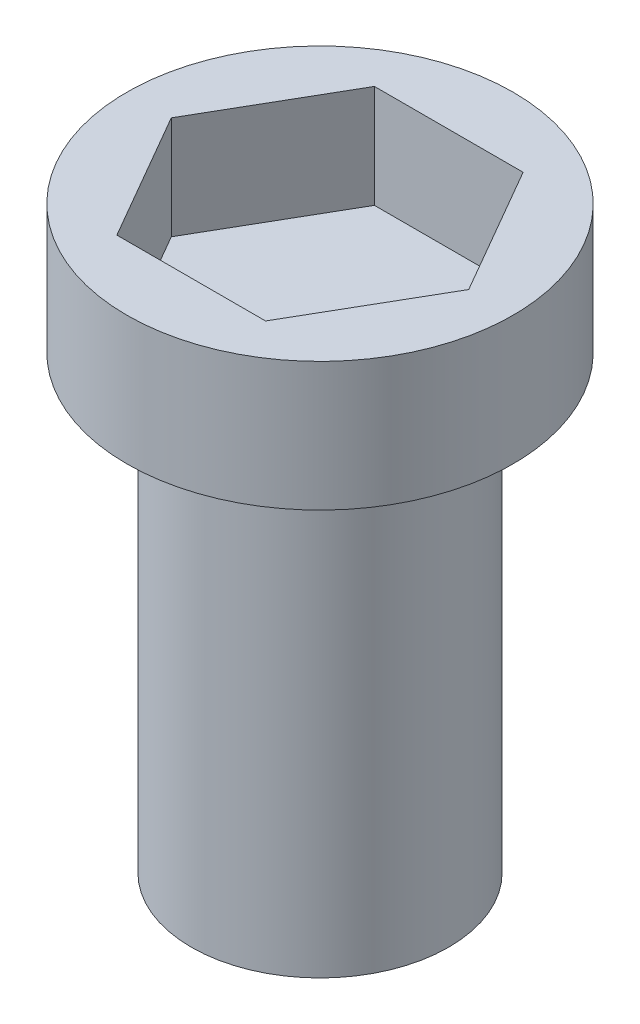
ISO-10303-21;
HEADER;
FILE_DESCRIPTION(('STEP AP214'),'2;1');
FILE_NAME('part.step','',(''),(''),'','','');
FILE_SCHEMA(('AUTOMOTIVE_DESIGN { 1 0 10303 214 1 1 1 1 }'));
ENDSEC;
DATA;
#1=APPLICATION_CONTEXT('core data for automotive mechanical design processes');
#2=APPLICATION_PROTOCOL_DEFINITION('international standard','automotive_design',2000,#1);
#3=PRODUCT_CONTEXT('',#1,'mechanical');
#4=PRODUCT('Part','Part','',(#3));
#5=PRODUCT_RELATED_PRODUCT_CATEGORY('part','',(#4));
#6=PRODUCT_DEFINITION_FORMATION('','',#4);
#7=PRODUCT_DEFINITION_CONTEXT('part definition',#1,'design');
#8=PRODUCT_DEFINITION('design','',#6,#7);
#9=PRODUCT_DEFINITION_SHAPE('','',#8);
#10=(LENGTH_UNIT() NAMED_UNIT(*) SI_UNIT(.MILLI.,.METRE.));
#11=(NAMED_UNIT(*) PLANE_ANGLE_UNIT() SI_UNIT($,.RADIAN.));
#12=(NAMED_UNIT(*) SI_UNIT($,.STERADIAN.) SOLID_ANGLE_UNIT());
#13=UNCERTAINTY_MEASURE_WITH_UNIT(LENGTH_MEASURE(1.E-05),#10,'distance_accuracy_value','');
#14=(GEOMETRIC_REPRESENTATION_CONTEXT(3) GLOBAL_UNCERTAINTY_ASSIGNED_CONTEXT((#13)) GLOBAL_UNIT_ASSIGNED_CONTEXT((#10,
#11,#12)) REPRESENTATION_CONTEXT('',''));
#15=CARTESIAN_POINT('',(0.,0.,0.));
#16=DIRECTION('',(0.,0.,1.));
#17=DIRECTION('',(1.,0.,0.));
#18=AXIS2_PLACEMENT_3D('',#15,#16,#17);
#19=CARTESIAN_POINT('',(0.,35.,0.));
#20=DIRECTION('',(0.,-1.,0.));
#21=DIRECTION('',(0.,0.,-1.));
#22=AXIS2_PLACEMENT_3D('',#19,#20,#21);
#23=CYLINDRICAL_SURFACE('',#22,10.);
#24=CARTESIAN_POINT('',(0.,35.,0.));
#25=DIRECTION('',(0.,1.,0.));
#26=DIRECTION('',(0.,0.,1.));
#27=AXIS2_PLACEMENT_3D('',#24,#25,#26);
#28=CIRCLE('',#27,10.);
#29=CARTESIAN_POINT('',(0.,35.,10.));
#30=VERTEX_POINT('',#29);
#31=EDGE_CURVE('E11',#30,#30,#28,.T.);
#32=ORIENTED_EDGE('',*,*,#31,.F.);
#33=EDGE_LOOP('',(#32));
#34=FACE_BOUND('',#33,.T.);
#35=CARTESIAN_POINT('',(0.,0.,0.));
#36=DIRECTION('',(0.,1.,0.));
#37=DIRECTION('',(0.,0.,1.));
#38=AXIS2_PLACEMENT_3D('',#35,#36,#37);
#39=CIRCLE('',#38,10.);
#40=CARTESIAN_POINT('',(0.,0.,10.));
#41=VERTEX_POINT('',#40);
#42=EDGE_CURVE('E46',#41,#41,#39,.T.);
#43=ORIENTED_EDGE('',*,*,#42,.T.);
#44=EDGE_LOOP('',(#43));
#45=FACE_BOUND('',#44,.T.);
#46=ADVANCED_FACE('F43',(#34,#45),#23,.T.);
#47=CARTESIAN_POINT('',(0.,0.,0.));
#48=DIRECTION('',(0.,1.,0.));
#49=DIRECTION('',(0.,0.,1.));
#50=AXIS2_PLACEMENT_3D('',#47,#48,#49);
#51=PLANE('',#50);
#52=ORIENTED_EDGE('',*,*,#42,.F.);
#53=EDGE_LOOP('',(#52));
#54=FACE_BOUND('',#53,.T.);
#55=ADVANCED_FACE('F181',(#54),#51,.F.);
#56=CARTESIAN_POINT('',(0.,35.,0.));
#57=DIRECTION('',(0.,1.,0.));
#58=DIRECTION('',(0.,0.,1.));
#59=AXIS2_PLACEMENT_3D('',#56,#57,#58);
#60=PLANE('',#59);
#61=ORIENTED_EDGE('',*,*,#31,.T.);
#62=EDGE_LOOP('',(#61));
#63=FACE_BOUND('',#62,.T.);
#64=CARTESIAN_POINT('',(0.,35.,0.));
#65=DIRECTION('',(0.,1.,0.));
#66=DIRECTION('',(0.,0.,1.));
#67=AXIS2_PLACEMENT_3D('',#64,#65,#66);
#68=CIRCLE('',#67,15.);
#69=CARTESIAN_POINT('',(0.,35.,15.));
#70=VERTEX_POINT('',#69);
#71=EDGE_CURVE('E110',#70,#70,#68,.T.);
#72=ORIENTED_EDGE('',*,*,#71,.F.);
#73=EDGE_LOOP('',(#72));
#74=FACE_BOUND('',#73,.T.);
#75=ADVANCED_FACE('F183',(#63,#74),#60,.F.);
#76=CARTESIAN_POINT('',(0.,45.,0.));
#77=DIRECTION('',(0.,1.,0.));
#78=DIRECTION('',(0.,0.,1.));
#79=AXIS2_PLACEMENT_3D('',#76,#77,#78);
#80=PLANE('',#79);
#81=CARTESIAN_POINT('',(0.,45.,0.));
#82=DIRECTION('',(0.,1.,0.));
#83=DIRECTION('',(0.,0.,1.));
#84=AXIS2_PLACEMENT_3D('',#81,#82,#83);
#85=CIRCLE('',#84,15.);
#86=CARTESIAN_POINT('',(0.,45.,15.));
#87=VERTEX_POINT('',#86);
#88=EDGE_CURVE('E148',#87,#87,#85,.T.);
#89=ORIENTED_EDGE('',*,*,#88,.T.);
#90=EDGE_LOOP('',(#89));
#91=FACE_BOUND('',#90,.T.);
#92=DIRECTION('',(-0.5,0.,-0.866025403784439));
#93=VECTOR('',#92,1.);
#94=CARTESIAN_POINT('',(11.5470053837925,45.,0.));
#95=LINE('',#94,#93);
#96=CARTESIAN_POINT('',(11.5470053837925,45.,0.));
#97=VERTEX_POINT('',#96);
#98=CARTESIAN_POINT('',(5.77350269189626,45.,-10.));
#99=VERTEX_POINT('',#98);
#100=EDGE_CURVE('E105',#97,#99,#95,.T.);
#101=ORIENTED_EDGE('',*,*,#100,.F.);
#102=DIRECTION('',(0.5,0.,-0.866025403784439));
#103=VECTOR('',#102,1.);
#104=CARTESIAN_POINT('',(5.77350269189626,45.,10.));
#105=LINE('',#104,#103);
#106=CARTESIAN_POINT('',(5.77350269189626,45.,10.));
#107=VERTEX_POINT('',#106);
#108=EDGE_CURVE('E97',#107,#97,#105,.T.);
#109=ORIENTED_EDGE('',*,*,#108,.F.);
#110=DIRECTION('',(1.,0.,0.));
#111=VECTOR('',#110,1.);
#112=CARTESIAN_POINT('',(-5.77350269189626,45.,10.));
#113=LINE('',#112,#111);
#114=CARTESIAN_POINT('',(-5.77350269189626,45.,10.));
#115=VERTEX_POINT('',#114);
#116=EDGE_CURVE('E129',#115,#107,#113,.T.);
#117=ORIENTED_EDGE('',*,*,#116,.F.);
#118=DIRECTION('',(0.5,0.,0.866025403784438));
#119=VECTOR('',#118,1.);
#120=CARTESIAN_POINT('',(-11.5470053837925,45.,0.));
#121=LINE('',#120,#119);
#122=CARTESIAN_POINT('',(-11.5470053837925,45.,0.));
#123=VERTEX_POINT('',#122);
#124=EDGE_CURVE('E125',#123,#115,#121,.T.);
#125=ORIENTED_EDGE('',*,*,#124,.F.);
#126=DIRECTION('',(-0.5,0.,0.866025403784438));
#127=VECTOR('',#126,1.);
#128=CARTESIAN_POINT('',(-5.77350269189626,45.,-10.));
#129=LINE('',#128,#127);
#130=CARTESIAN_POINT('',(-5.77350269189626,45.,-10.));
#131=VERTEX_POINT('',#130);
#132=EDGE_CURVE('E120',#131,#123,#129,.T.);
#133=ORIENTED_EDGE('',*,*,#132,.F.);
#134=DIRECTION('',(-1.,0.,0.));
#135=VECTOR('',#134,1.);
#136=CARTESIAN_POINT('',(5.77350269189626,45.,-10.));
#137=LINE('',#136,#135);
#138=EDGE_CURVE('E116',#99,#131,#137,.T.);
#139=ORIENTED_EDGE('',*,*,#138,.F.);
#140=EDGE_LOOP('',(#101,#109,#117,#125,#133,#139));
#141=FACE_BOUND('',#140,.T.);
#142=ADVANCED_FACE('F114',(#91,#141),#80,.T.);
#143=CARTESIAN_POINT('',(0.,45.,0.));
#144=DIRECTION('',(0.,-1.,0.));
#145=DIRECTION('',(0.,0.,-1.));
#146=AXIS2_PLACEMENT_3D('',#143,#144,#145);
#147=CYLINDRICAL_SURFACE('',#146,15.);
#148=ORIENTED_EDGE('',*,*,#88,.F.);
#149=EDGE_LOOP('',(#148));
#150=FACE_BOUND('',#149,.T.);
#151=ORIENTED_EDGE('',*,*,#71,.T.);
#152=EDGE_LOOP('',(#151));
#153=FACE_BOUND('',#152,.T.);
#154=ADVANCED_FACE('F196',(#150,#153),#147,.T.);
#155=CARTESIAN_POINT('',(5.77350269189626,45.,10.));
#156=DIRECTION('',(-0.866025403784439,0.,-0.5));
#157=DIRECTION('',(-0.5,0.,0.866025403784439));
#158=AXIS2_PLACEMENT_3D('',#155,#156,#157);
#159=PLANE('',#158);
#160=DIRECTION('',(0.,-1.,0.));
#161=VECTOR('',#160,1.);
#162=CARTESIAN_POINT('',(11.5470053837925,45.,0.));
#163=LINE('',#162,#161);
#164=CARTESIAN_POINT('',(11.5470053837925,37.,0.));
#165=VERTEX_POINT('',#164);
#166=EDGE_CURVE('E99',#97,#165,#163,.T.);
#167=ORIENTED_EDGE('',*,*,#166,.T.);
#168=DIRECTION('',(0.499999999999995,0.,-0.866025403784442));
#169=VECTOR('',#168,1.);
#170=CARTESIAN_POINT('',(5.77350269189638,37.,9.99999999999993));
#171=LINE('',#170,#169);
#172=CARTESIAN_POINT('',(5.77350269189638,37.,9.99999999999993));
#173=VERTEX_POINT('',#172);
#174=EDGE_CURVE('E152',#173,#165,#171,.T.);
#175=ORIENTED_EDGE('',*,*,#174,.F.);
#176=DIRECTION('',(0.,-1.,0.));
#177=VECTOR('',#176,1.);
#178=CARTESIAN_POINT('',(5.77350269189626,45.,10.));
#179=LINE('',#178,#177);
#180=EDGE_CURVE('E58',#107,#173,#179,.T.);
#181=ORIENTED_EDGE('',*,*,#180,.F.);
#182=ORIENTED_EDGE('',*,*,#108,.T.);
#183=EDGE_LOOP('',(#167,#175,#181,#182));
#184=FACE_BOUND('',#183,.T.);
#185=ADVANCED_FACE('F98',(#184),#159,.T.);
#186=CARTESIAN_POINT('',(11.5470053837925,45.,0.));
#187=DIRECTION('',(-0.866025403784438,0.,0.5));
#188=DIRECTION('',(0.5,0.,0.866025403784438));
#189=AXIS2_PLACEMENT_3D('',#186,#187,#188);
#190=PLANE('',#189);
#191=DIRECTION('',(0.,-1.,0.));
#192=VECTOR('',#191,1.);
#193=CARTESIAN_POINT('',(5.77350269189626,45.,-10.));
#194=LINE('',#193,#192);
#195=CARTESIAN_POINT('',(5.77350269189626,37.,-10.));
#196=VERTEX_POINT('',#195);
#197=EDGE_CURVE('E111',#99,#196,#194,.T.);
#198=ORIENTED_EDGE('',*,*,#197,.T.);
#199=DIRECTION('',(-0.500000000000001,0.,-0.866025403784438));
#200=VECTOR('',#199,1.);
#201=CARTESIAN_POINT('',(11.5470053837925,37.,0.));
#202=LINE('',#201,#200);
#203=EDGE_CURVE('E66',#165,#196,#202,.T.);
#204=ORIENTED_EDGE('',*,*,#203,.F.);
#205=ORIENTED_EDGE('',*,*,#166,.F.);
#206=ORIENTED_EDGE('',*,*,#100,.T.);
#207=EDGE_LOOP('',(#198,#204,#205,#206));
#208=FACE_BOUND('',#207,.T.);
#209=ADVANCED_FACE('F107',(#208),#190,.T.);
#210=CARTESIAN_POINT('',(5.77350269189626,45.,-10.));
#211=DIRECTION('',(0.,0.,1.));
#212=DIRECTION('',(1.,0.,0.));
#213=AXIS2_PLACEMENT_3D('',#210,#211,#212);
#214=PLANE('',#213);
#215=DIRECTION('',(0.,-1.,0.));
#216=VECTOR('',#215,1.);
#217=CARTESIAN_POINT('',(-5.77350269189626,45.,-10.));
#218=LINE('',#217,#216);
#219=CARTESIAN_POINT('',(-5.77350269189626,37.,-10.));
#220=VERTEX_POINT('',#219);
#221=EDGE_CURVE('E142',#131,#220,#218,.T.);
#222=ORIENTED_EDGE('',*,*,#221,.T.);
#223=DIRECTION('',(-1.,0.,0.));
#224=VECTOR('',#223,1.);
#225=CARTESIAN_POINT('',(5.77350269189623,37.,-10.));
#226=LINE('',#225,#224);
#227=EDGE_CURVE('E160',#196,#220,#226,.T.);
#228=ORIENTED_EDGE('',*,*,#227,.F.);
#229=ORIENTED_EDGE('',*,*,#197,.F.);
#230=ORIENTED_EDGE('',*,*,#138,.T.);
#231=EDGE_LOOP('',(#222,#228,#229,#230));
#232=FACE_BOUND('',#231,.T.);
#233=ADVANCED_FACE('F207',(#232),#214,.T.);
#234=CARTESIAN_POINT('',(-5.77350269189626,45.,-10.));
#235=DIRECTION('',(0.866025403784438,0.,0.5));
#236=DIRECTION('',(0.5,0.,-0.866025403784438));
#237=AXIS2_PLACEMENT_3D('',#234,#235,#236);
#238=PLANE('',#237);
#239=DIRECTION('',(0.,-1.,0.));
#240=VECTOR('',#239,1.);
#241=CARTESIAN_POINT('',(-11.5470053837925,45.,0.));
#242=LINE('',#241,#240);
#243=CARTESIAN_POINT('',(-11.5470053837925,37.,0.));
#244=VERTEX_POINT('',#243);
#245=EDGE_CURVE('E138',#123,#244,#242,.T.);
#246=ORIENTED_EDGE('',*,*,#245,.T.);
#247=DIRECTION('',(-0.499999999999995,0.,0.866025403784442));
#248=VECTOR('',#247,1.);
#249=CARTESIAN_POINT('',(-5.77350269189631,37.,-9.99999999999998));
#250=LINE('',#249,#248);
#251=EDGE_CURVE('E164',#220,#244,#250,.T.);
#252=ORIENTED_EDGE('',*,*,#251,.F.);
#253=ORIENTED_EDGE('',*,*,#221,.F.);
#254=ORIENTED_EDGE('',*,*,#132,.T.);
#255=EDGE_LOOP('',(#246,#252,#253,#254));
#256=FACE_BOUND('',#255,.T.);
#257=ADVANCED_FACE('F210',(#256),#238,.T.);
#258=CARTESIAN_POINT('',(-11.5470053837925,45.,0.));
#259=DIRECTION('',(0.866025403784438,0.,-0.5));
#260=DIRECTION('',(-0.5,0.,-0.866025403784438));
#261=AXIS2_PLACEMENT_3D('',#258,#259,#260);
#262=PLANE('',#261);
#263=DIRECTION('',(0.,-1.,0.));
#264=VECTOR('',#263,1.);
#265=CARTESIAN_POINT('',(-5.77350269189626,45.,10.));
#266=LINE('',#265,#264);
#267=CARTESIAN_POINT('',(-5.77350269189626,37.,10.));
#268=VERTEX_POINT('',#267);
#269=EDGE_CURVE('E134',#115,#268,#266,.T.);
#270=ORIENTED_EDGE('',*,*,#269,.T.);
#271=DIRECTION('',(0.500000000000007,0.,0.866025403784434));
#272=VECTOR('',#271,1.);
#273=CARTESIAN_POINT('',(-11.5470053837925,37.,0.));
#274=LINE('',#273,#272);
#275=EDGE_CURVE('E168',#244,#268,#274,.T.);
#276=ORIENTED_EDGE('',*,*,#275,.F.);
#277=ORIENTED_EDGE('',*,*,#245,.F.);
#278=ORIENTED_EDGE('',*,*,#124,.T.);
#279=EDGE_LOOP('',(#270,#276,#277,#278));
#280=FACE_BOUND('',#279,.T.);
#281=ADVANCED_FACE('F214',(#280),#262,.T.);
#282=CARTESIAN_POINT('',(-5.77350269189626,45.,10.));
#283=DIRECTION('',(0.,0.,-1.));
#284=DIRECTION('',(-1.,0.,0.));
#285=AXIS2_PLACEMENT_3D('',#282,#283,#284);
#286=PLANE('',#285);
#287=ORIENTED_EDGE('',*,*,#180,.T.);
#288=DIRECTION('',(1.,0.,0.));
#289=VECTOR('',#288,1.);
#290=CARTESIAN_POINT('',(-5.77350269189616,37.,10.0000000000001));
#291=LINE('',#290,#289);
#292=EDGE_CURVE('E172',#268,#173,#291,.T.);
#293=ORIENTED_EDGE('',*,*,#292,.F.);
#294=ORIENTED_EDGE('',*,*,#269,.F.);
#295=ORIENTED_EDGE('',*,*,#116,.T.);
#296=EDGE_LOOP('',(#287,#293,#294,#295));
#297=FACE_BOUND('',#296,.T.);
#298=ADVANCED_FACE('F195',(#297),#286,.T.);
#299=CARTESIAN_POINT('',(0.,37.,0.));
#300=DIRECTION('',(0.,1.,0.));
#301=DIRECTION('',(0.,0.,1.));
#302=AXIS2_PLACEMENT_3D('',#299,#300,#301);
#303=PLANE('',#302);
#304=ORIENTED_EDGE('',*,*,#174,.T.);
#305=ORIENTED_EDGE('',*,*,#203,.T.);
#306=ORIENTED_EDGE('',*,*,#227,.T.);
#307=ORIENTED_EDGE('',*,*,#251,.T.);
#308=ORIENTED_EDGE('',*,*,#275,.T.);
#309=ORIENTED_EDGE('',*,*,#292,.T.);
#310=EDGE_LOOP('',(#304,#305,#306,#307,#308,#309));
#311=FACE_BOUND('',#310,.T.);
#312=ADVANCED_FACE('F192',(#311),#303,.T.);
#313=CLOSED_SHELL('',(#46,#55,#75,#142,#154,#185,#209,#233,#257,#281,#298,#312));
#314=MANIFOLD_SOLID_BREP('B2',#313);
#315=ADVANCED_BREP_SHAPE_REPRESENTATION('',(#18,#314),#14);
#316=SHAPE_DEFINITION_REPRESENTATION(#9,#315);
ENDSEC;
END-ISO-10303-21;
